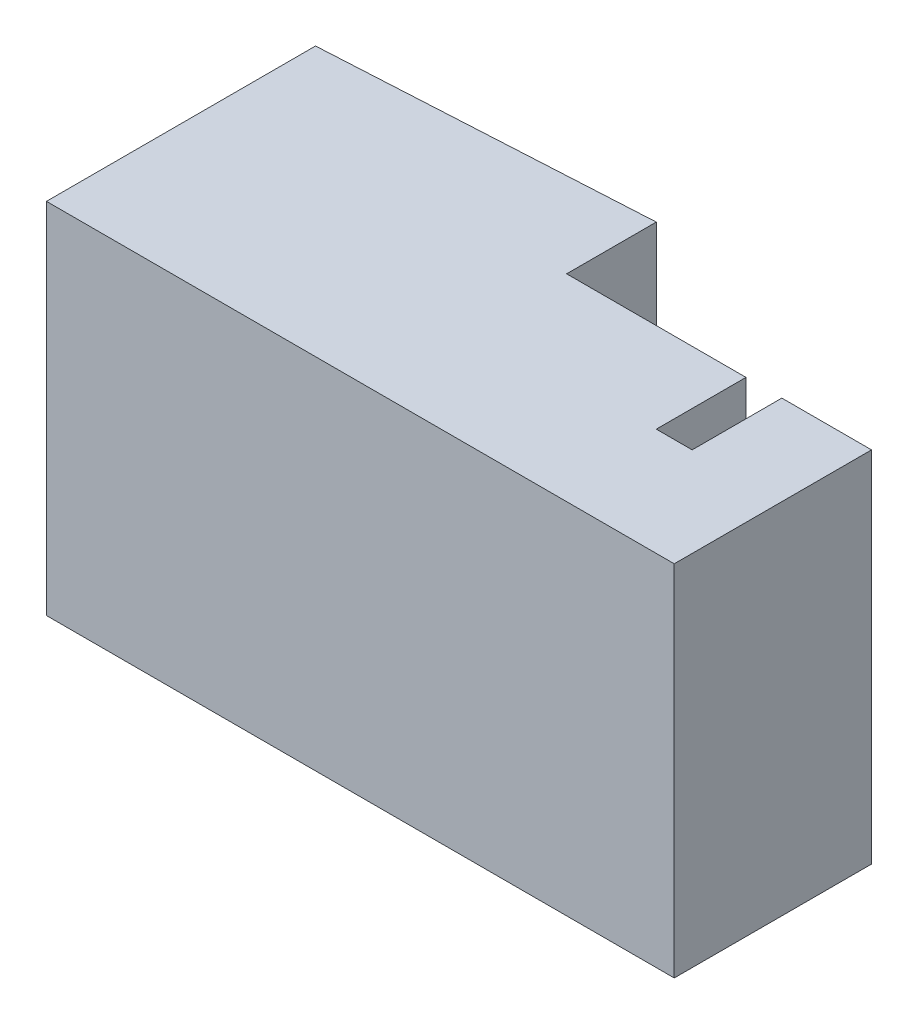
ISO-10303-21;
HEADER;
FILE_DESCRIPTION(('STEP AP214'),'2;1');
FILE_NAME('part.step','',(''),(''),'','','');
FILE_SCHEMA(('AUTOMOTIVE_DESIGN { 1 0 10303 214 1 1 1 1 }'));
ENDSEC;
DATA;
#1=APPLICATION_CONTEXT('core data for automotive mechanical design processes');
#2=APPLICATION_PROTOCOL_DEFINITION('international standard','automotive_design',2000,#1);
#3=PRODUCT_CONTEXT('',#1,'mechanical');
#4=PRODUCT('Part','Part','',(#3));
#5=PRODUCT_RELATED_PRODUCT_CATEGORY('part','',(#4));
#6=PRODUCT_DEFINITION_FORMATION('','',#4);
#7=PRODUCT_DEFINITION_CONTEXT('part definition',#1,'design');
#8=PRODUCT_DEFINITION('design','',#6,#7);
#9=PRODUCT_DEFINITION_SHAPE('','',#8);
#10=(LENGTH_UNIT() NAMED_UNIT(*) SI_UNIT(.MILLI.,.METRE.));
#11=(NAMED_UNIT(*) PLANE_ANGLE_UNIT() SI_UNIT($,.RADIAN.));
#12=(NAMED_UNIT(*) SI_UNIT($,.STERADIAN.) SOLID_ANGLE_UNIT());
#13=UNCERTAINTY_MEASURE_WITH_UNIT(LENGTH_MEASURE(1.E-05),#10,'distance_accuracy_value','');
#14=(GEOMETRIC_REPRESENTATION_CONTEXT(3) GLOBAL_UNCERTAINTY_ASSIGNED_CONTEXT((#13)) GLOBAL_UNIT_ASSIGNED_CONTEXT((#10,
#11,#12)) REPRESENTATION_CONTEXT('',''));
#15=CARTESIAN_POINT('',(0.,0.,0.));
#16=DIRECTION('',(0.,0.,1.));
#17=DIRECTION('',(1.,0.,0.));
#18=AXIS2_PLACEMENT_3D('',#15,#16,#17);
#19=CARTESIAN_POINT('',(0.,20.,0.));
#20=DIRECTION('',(1.,0.,0.));
#21=DIRECTION('',(0.,0.,-1.));
#22=AXIS2_PLACEMENT_3D('',#19,#20,#21);
#23=PLANE('',#22);
#24=DIRECTION('',(0.,0.,1.));
#25=VECTOR('',#24,1.);
#26=CARTESIAN_POINT('',(0.,0.,0.));
#27=LINE('',#26,#25);
#28=CARTESIAN_POINT('',(0.,0.,-15.));
#29=VERTEX_POINT('',#28);
#30=CARTESIAN_POINT('',(0.,0.,0.));
#31=VERTEX_POINT('',#30);
#32=EDGE_CURVE('E141',#29,#31,#27,.T.);
#33=ORIENTED_EDGE('',*,*,#32,.T.);
#34=DIRECTION('',(0.,-1.,0.));
#35=VECTOR('',#34,1.);
#36=CARTESIAN_POINT('',(0.,20.,0.));
#37=LINE('',#36,#35);
#38=CARTESIAN_POINT('',(0.,20.,0.));
#39=VERTEX_POINT('',#38);
#40=EDGE_CURVE('E11',#39,#31,#37,.T.);
#41=ORIENTED_EDGE('',*,*,#40,.F.);
#42=DIRECTION('',(0.,0.,1.));
#43=VECTOR('',#42,1.);
#44=CARTESIAN_POINT('',(0.,20.,0.));
#45=LINE('',#44,#43);
#46=CARTESIAN_POINT('',(0.,20.,-15.));
#47=VERTEX_POINT('',#46);
#48=EDGE_CURVE('E159',#47,#39,#45,.T.);
#49=ORIENTED_EDGE('',*,*,#48,.F.);
#50=DIRECTION('',(0.,-1.,0.));
#51=VECTOR('',#50,1.);
#52=CARTESIAN_POINT('',(0.,20.,-15.));
#53=LINE('',#52,#51);
#54=EDGE_CURVE('E137',#47,#29,#53,.T.);
#55=ORIENTED_EDGE('',*,*,#54,.T.);
#56=EDGE_LOOP('',(#33,#41,#49,#55));
#57=FACE_BOUND('',#56,.T.);
#58=ADVANCED_FACE('F33',(#57),#23,.F.);
#59=CARTESIAN_POINT('',(0.,20.,0.));
#60=DIRECTION('',(0.,0.,-1.));
#61=DIRECTION('',(-1.,0.,0.));
#62=AXIS2_PLACEMENT_3D('',#59,#60,#61);
#63=PLANE('',#62);
#64=DIRECTION('',(1.,0.,0.));
#65=VECTOR('',#64,1.);
#66=CARTESIAN_POINT('',(0.,0.,0.));
#67=LINE('',#66,#65);
#68=CARTESIAN_POINT('',(35.,0.,0.));
#69=VERTEX_POINT('',#68);
#70=EDGE_CURVE('E144',#31,#69,#67,.T.);
#71=ORIENTED_EDGE('',*,*,#70,.T.);
#72=DIRECTION('',(0.,-1.,0.));
#73=VECTOR('',#72,1.);
#74=CARTESIAN_POINT('',(35.,20.,0.));
#75=LINE('',#74,#73);
#76=CARTESIAN_POINT('',(35.,20.,0.));
#77=VERTEX_POINT('',#76);
#78=EDGE_CURVE('E41',#77,#69,#75,.T.);
#79=ORIENTED_EDGE('',*,*,#78,.F.);
#80=DIRECTION('',(1.,0.,0.));
#81=VECTOR('',#80,1.);
#82=CARTESIAN_POINT('',(0.,20.,0.));
#83=LINE('',#82,#81);
#84=EDGE_CURVE('E98',#39,#77,#83,.T.);
#85=ORIENTED_EDGE('',*,*,#84,.F.);
#86=ORIENTED_EDGE('',*,*,#40,.T.);
#87=EDGE_LOOP('',(#71,#79,#85,#86));
#88=FACE_BOUND('',#87,.T.);
#89=ADVANCED_FACE('F208',(#88),#63,.F.);
#90=CARTESIAN_POINT('',(35.,20.,-11.));
#91=DIRECTION('',(-1.,0.,0.));
#92=DIRECTION('',(0.,0.,1.));
#93=AXIS2_PLACEMENT_3D('',#90,#91,#92);
#94=PLANE('',#93);
#95=DIRECTION('',(0.,0.,-1.));
#96=VECTOR('',#95,1.);
#97=CARTESIAN_POINT('',(35.,0.,-11.));
#98=LINE('',#97,#96);
#99=CARTESIAN_POINT('',(35.,0.,-11.));
#100=VERTEX_POINT('',#99);
#101=EDGE_CURVE('E146',#69,#100,#98,.T.);
#102=ORIENTED_EDGE('',*,*,#101,.T.);
#103=DIRECTION('',(0.,-1.,0.));
#104=VECTOR('',#103,1.);
#105=CARTESIAN_POINT('',(35.,20.,-11.));
#106=LINE('',#105,#104);
#107=CARTESIAN_POINT('',(35.,20.,-11.));
#108=VERTEX_POINT('',#107);
#109=EDGE_CURVE('E172',#108,#100,#106,.T.);
#110=ORIENTED_EDGE('',*,*,#109,.F.);
#111=DIRECTION('',(0.,0.,-1.));
#112=VECTOR('',#111,1.);
#113=CARTESIAN_POINT('',(35.,20.,-11.));
#114=LINE('',#113,#112);
#115=EDGE_CURVE('E180',#77,#108,#114,.T.);
#116=ORIENTED_EDGE('',*,*,#115,.F.);
#117=ORIENTED_EDGE('',*,*,#78,.T.);
#118=EDGE_LOOP('',(#102,#110,#116,#117));
#119=FACE_BOUND('',#118,.T.);
#120=ADVANCED_FACE('F178',(#119),#94,.F.);
#121=CARTESIAN_POINT('',(30.,20.,-11.));
#122=DIRECTION('',(0.,0.,1.));
#123=DIRECTION('',(1.,0.,0.));
#124=AXIS2_PLACEMENT_3D('',#121,#122,#123);
#125=PLANE('',#124);
#126=DIRECTION('',(-1.,0.,0.));
#127=VECTOR('',#126,1.);
#128=CARTESIAN_POINT('',(30.,0.,-11.));
#129=LINE('',#128,#127);
#130=CARTESIAN_POINT('',(30.,0.,-11.));
#131=VERTEX_POINT('',#130);
#132=EDGE_CURVE('E148',#100,#131,#129,.T.);
#133=ORIENTED_EDGE('',*,*,#132,.T.);
#134=DIRECTION('',(0.,-1.,0.));
#135=VECTOR('',#134,1.);
#136=CARTESIAN_POINT('',(30.,20.,-11.));
#137=LINE('',#136,#135);
#138=CARTESIAN_POINT('',(30.,20.,-11.));
#139=VERTEX_POINT('',#138);
#140=EDGE_CURVE('E169',#139,#131,#137,.T.);
#141=ORIENTED_EDGE('',*,*,#140,.F.);
#142=DIRECTION('',(-1.,0.,0.));
#143=VECTOR('',#142,1.);
#144=CARTESIAN_POINT('',(30.,20.,-11.));
#145=LINE('',#144,#143);
#146=EDGE_CURVE('E198',#108,#139,#145,.T.);
#147=ORIENTED_EDGE('',*,*,#146,.F.);
#148=ORIENTED_EDGE('',*,*,#109,.T.);
#149=EDGE_LOOP('',(#133,#141,#147,#148));
#150=FACE_BOUND('',#149,.T.);
#151=ADVANCED_FACE('F189',(#150),#125,.F.);
#152=CARTESIAN_POINT('',(30.,20.,-6.));
#153=DIRECTION('',(1.,0.,0.));
#154=DIRECTION('',(0.,0.,-1.));
#155=AXIS2_PLACEMENT_3D('',#152,#153,#154);
#156=PLANE('',#155);
#157=DIRECTION('',(0.,0.,1.));
#158=VECTOR('',#157,1.);
#159=CARTESIAN_POINT('',(30.,0.,-6.));
#160=LINE('',#159,#158);
#161=CARTESIAN_POINT('',(30.,0.,-6.));
#162=VERTEX_POINT('',#161);
#163=EDGE_CURVE('E150',#131,#162,#160,.T.);
#164=ORIENTED_EDGE('',*,*,#163,.T.);
#165=DIRECTION('',(0.,-1.,0.));
#166=VECTOR('',#165,1.);
#167=CARTESIAN_POINT('',(30.,20.,-6.));
#168=LINE('',#167,#166);
#169=CARTESIAN_POINT('',(30.,20.,-6.));
#170=VERTEX_POINT('',#169);
#171=EDGE_CURVE('E166',#170,#162,#168,.T.);
#172=ORIENTED_EDGE('',*,*,#171,.F.);
#173=DIRECTION('',(0.,0.,1.));
#174=VECTOR('',#173,1.);
#175=CARTESIAN_POINT('',(30.,20.,-6.));
#176=LINE('',#175,#174);
#177=EDGE_CURVE('E195',#139,#170,#176,.T.);
#178=ORIENTED_EDGE('',*,*,#177,.F.);
#179=ORIENTED_EDGE('',*,*,#140,.T.);
#180=EDGE_LOOP('',(#164,#172,#178,#179));
#181=FACE_BOUND('',#180,.T.);
#182=ADVANCED_FACE('F193',(#181),#156,.F.);
#183=CARTESIAN_POINT('',(28.,20.,-6.));
#184=DIRECTION('',(0.,0.,1.));
#185=DIRECTION('',(1.,0.,0.));
#186=AXIS2_PLACEMENT_3D('',#183,#184,#185);
#187=PLANE('',#186);
#188=DIRECTION('',(-1.,0.,0.));
#189=VECTOR('',#188,1.);
#190=CARTESIAN_POINT('',(28.,0.,-6.));
#191=LINE('',#190,#189);
#192=CARTESIAN_POINT('',(28.,0.,-6.));
#193=VERTEX_POINT('',#192);
#194=EDGE_CURVE('E152',#162,#193,#191,.T.);
#195=ORIENTED_EDGE('',*,*,#194,.T.);
#196=DIRECTION('',(0.,-1.,0.));
#197=VECTOR('',#196,1.);
#198=CARTESIAN_POINT('',(28.,20.,-6.));
#199=LINE('',#198,#197);
#200=CARTESIAN_POINT('',(28.,20.,-6.));
#201=VERTEX_POINT('',#200);
#202=EDGE_CURVE('E163',#201,#193,#199,.T.);
#203=ORIENTED_EDGE('',*,*,#202,.F.);
#204=DIRECTION('',(-1.,0.,0.));
#205=VECTOR('',#204,1.);
#206=CARTESIAN_POINT('',(28.,20.,-6.));
#207=LINE('',#206,#205);
#208=EDGE_CURVE('E197',#170,#201,#207,.T.);
#209=ORIENTED_EDGE('',*,*,#208,.F.);
#210=ORIENTED_EDGE('',*,*,#171,.T.);
#211=EDGE_LOOP('',(#195,#203,#209,#210));
#212=FACE_BOUND('',#211,.T.);
#213=ADVANCED_FACE('F220',(#212),#187,.F.);
#214=CARTESIAN_POINT('',(28.,20.,-11.));
#215=DIRECTION('',(-1.,0.,0.));
#216=DIRECTION('',(0.,0.,1.));
#217=AXIS2_PLACEMENT_3D('',#214,#215,#216);
#218=PLANE('',#217);
#219=DIRECTION('',(0.,0.,-1.));
#220=VECTOR('',#219,1.);
#221=CARTESIAN_POINT('',(28.,0.,-11.));
#222=LINE('',#221,#220);
#223=CARTESIAN_POINT('',(28.,0.,-11.));
#224=VERTEX_POINT('',#223);
#225=EDGE_CURVE('E154',#193,#224,#222,.T.);
#226=ORIENTED_EDGE('',*,*,#225,.T.);
#227=DIRECTION('',(0.,-1.,0.));
#228=VECTOR('',#227,1.);
#229=CARTESIAN_POINT('',(28.,20.,-11.));
#230=LINE('',#229,#228);
#231=CARTESIAN_POINT('',(28.,20.,-11.));
#232=VERTEX_POINT('',#231);
#233=EDGE_CURVE('E132',#232,#224,#230,.T.);
#234=ORIENTED_EDGE('',*,*,#233,.F.);
#235=DIRECTION('',(0.,0.,-1.));
#236=VECTOR('',#235,1.);
#237=CARTESIAN_POINT('',(28.,20.,-11.));
#238=LINE('',#237,#236);
#239=EDGE_CURVE('E123',#201,#232,#238,.T.);
#240=ORIENTED_EDGE('',*,*,#239,.F.);
#241=ORIENTED_EDGE('',*,*,#202,.T.);
#242=EDGE_LOOP('',(#226,#234,#240,#241));
#243=FACE_BOUND('',#242,.T.);
#244=ADVANCED_FACE('F223',(#243),#218,.F.);
#245=CARTESIAN_POINT('',(18.,20.,-11.));
#246=DIRECTION('',(0.,0.,1.));
#247=DIRECTION('',(1.,0.,0.));
#248=AXIS2_PLACEMENT_3D('',#245,#246,#247);
#249=PLANE('',#248);
#250=DIRECTION('',(-1.,0.,0.));
#251=VECTOR('',#250,1.);
#252=CARTESIAN_POINT('',(18.,0.,-11.));
#253=LINE('',#252,#251);
#254=CARTESIAN_POINT('',(18.,0.,-11.));
#255=VERTEX_POINT('',#254);
#256=EDGE_CURVE('E131',#224,#255,#253,.T.);
#257=ORIENTED_EDGE('',*,*,#256,.T.);
#258=DIRECTION('',(0.,-1.,0.));
#259=VECTOR('',#258,1.);
#260=CARTESIAN_POINT('',(18.,20.,-11.));
#261=LINE('',#260,#259);
#262=CARTESIAN_POINT('',(18.,20.,-11.));
#263=VERTEX_POINT('',#262);
#264=EDGE_CURVE('E128',#263,#255,#261,.T.);
#265=ORIENTED_EDGE('',*,*,#264,.F.);
#266=DIRECTION('',(-1.,0.,0.));
#267=VECTOR('',#266,1.);
#268=CARTESIAN_POINT('',(18.,20.,-11.));
#269=LINE('',#268,#267);
#270=EDGE_CURVE('E117',#232,#263,#269,.T.);
#271=ORIENTED_EDGE('',*,*,#270,.F.);
#272=ORIENTED_EDGE('',*,*,#233,.T.);
#273=EDGE_LOOP('',(#257,#265,#271,#272));
#274=FACE_BOUND('',#273,.T.);
#275=ADVANCED_FACE('F129',(#274),#249,.F.);
#276=CARTESIAN_POINT('',(18.,20.,-16.));
#277=DIRECTION('',(-1.,0.,0.));
#278=DIRECTION('',(0.,0.,1.));
#279=AXIS2_PLACEMENT_3D('',#276,#277,#278);
#280=PLANE('',#279);
#281=DIRECTION('',(0.,0.,-1.));
#282=VECTOR('',#281,1.);
#283=CARTESIAN_POINT('',(18.,0.,-16.));
#284=LINE('',#283,#282);
#285=CARTESIAN_POINT('',(18.,0.,-16.));
#286=VERTEX_POINT('',#285);
#287=EDGE_CURVE('E84',#255,#286,#284,.T.);
#288=ORIENTED_EDGE('',*,*,#287,.T.);
#289=DIRECTION('',(0.,-1.,0.));
#290=VECTOR('',#289,1.);
#291=CARTESIAN_POINT('',(18.,20.,-16.));
#292=LINE('',#291,#290);
#293=CARTESIAN_POINT('',(18.,20.,-16.));
#294=VERTEX_POINT('',#293);
#295=EDGE_CURVE('E133',#294,#286,#292,.T.);
#296=ORIENTED_EDGE('',*,*,#295,.F.);
#297=DIRECTION('',(0.,0.,-1.));
#298=VECTOR('',#297,1.);
#299=CARTESIAN_POINT('',(18.,20.,-16.));
#300=LINE('',#299,#298);
#301=EDGE_CURVE('E121',#263,#294,#300,.T.);
#302=ORIENTED_EDGE('',*,*,#301,.F.);
#303=ORIENTED_EDGE('',*,*,#264,.T.);
#304=EDGE_LOOP('',(#288,#296,#302,#303));
#305=FACE_BOUND('',#304,.T.);
#306=ADVANCED_FACE('F135',(#305),#280,.F.);
#307=CARTESIAN_POINT('',(18.,20.,-16.));
#308=DIRECTION('',(0.055470019622523,0.,0.998460353205412));
#309=DIRECTION('',(0.998460353205412,0.,-0.055470019622523));
#310=AXIS2_PLACEMENT_3D('',#307,#308,#309);
#311=PLANE('',#310);
#312=DIRECTION('',(-0.998460353205412,0.,0.055470019622523));
#313=VECTOR('',#312,1.);
#314=CARTESIAN_POINT('',(18.,0.,-16.));
#315=LINE('',#314,#313);
#316=EDGE_CURVE('E90',#286,#29,#315,.T.);
#317=ORIENTED_EDGE('',*,*,#316,.T.);
#318=ORIENTED_EDGE('',*,*,#54,.F.);
#319=DIRECTION('',(-0.998460353205412,0.,0.055470019622523));
#320=VECTOR('',#319,1.);
#321=CARTESIAN_POINT('',(18.,20.,-16.));
#322=LINE('',#321,#320);
#323=EDGE_CURVE('E49',#294,#47,#322,.T.);
#324=ORIENTED_EDGE('',*,*,#323,.F.);
#325=ORIENTED_EDGE('',*,*,#295,.T.);
#326=EDGE_LOOP('',(#317,#318,#324,#325));
#327=FACE_BOUND('',#326,.T.);
#328=ADVANCED_FACE('F232',(#327),#311,.F.);
#329=CARTESIAN_POINT('',(0.,20.,0.));
#330=DIRECTION('',(0.,-1.,0.));
#331=DIRECTION('',(0.,0.,-1.));
#332=AXIS2_PLACEMENT_3D('',#329,#330,#331);
#333=PLANE('',#332);
#334=ORIENTED_EDGE('',*,*,#48,.T.);
#335=ORIENTED_EDGE('',*,*,#84,.T.);
#336=ORIENTED_EDGE('',*,*,#115,.T.);
#337=ORIENTED_EDGE('',*,*,#146,.T.);
#338=ORIENTED_EDGE('',*,*,#177,.T.);
#339=ORIENTED_EDGE('',*,*,#208,.T.);
#340=ORIENTED_EDGE('',*,*,#239,.T.);
#341=ORIENTED_EDGE('',*,*,#270,.T.);
#342=ORIENTED_EDGE('',*,*,#301,.T.);
#343=ORIENTED_EDGE('',*,*,#323,.T.);
#344=EDGE_LOOP('',(#334,#335,#336,#337,#338,#339,#340,#341,#342,#343));
#345=FACE_BOUND('',#344,.T.);
#346=ADVANCED_FACE('F119',(#345),#333,.F.);
#347=CARTESIAN_POINT('',(0.,0.,0.));
#348=DIRECTION('',(0.,-1.,0.));
#349=DIRECTION('',(0.,0.,-1.));
#350=AXIS2_PLACEMENT_3D('',#347,#348,#349);
#351=PLANE('',#350);
#352=ORIENTED_EDGE('',*,*,#32,.F.);
#353=ORIENTED_EDGE('',*,*,#316,.F.);
#354=ORIENTED_EDGE('',*,*,#287,.F.);
#355=ORIENTED_EDGE('',*,*,#256,.F.);
#356=ORIENTED_EDGE('',*,*,#225,.F.);
#357=ORIENTED_EDGE('',*,*,#194,.F.);
#358=ORIENTED_EDGE('',*,*,#163,.F.);
#359=ORIENTED_EDGE('',*,*,#132,.F.);
#360=ORIENTED_EDGE('',*,*,#101,.F.);
#361=ORIENTED_EDGE('',*,*,#70,.F.);
#362=EDGE_LOOP('',(#352,#353,#354,#355,#356,#357,#358,#359,#360,#361));
#363=FACE_BOUND('',#362,.T.);
#364=ADVANCED_FACE('F184',(#363),#351,.T.);
#365=CLOSED_SHELL('',(#58,#89,#120,#151,#182,#213,#244,#275,#306,#328,#346,#364));
#366=MANIFOLD_SOLID_BREP('B2',#365);
#367=ADVANCED_BREP_SHAPE_REPRESENTATION('',(#18,#366),#14);
#368=SHAPE_DEFINITION_REPRESENTATION(#9,#367);
ENDSEC;
END-ISO-10303-21;
